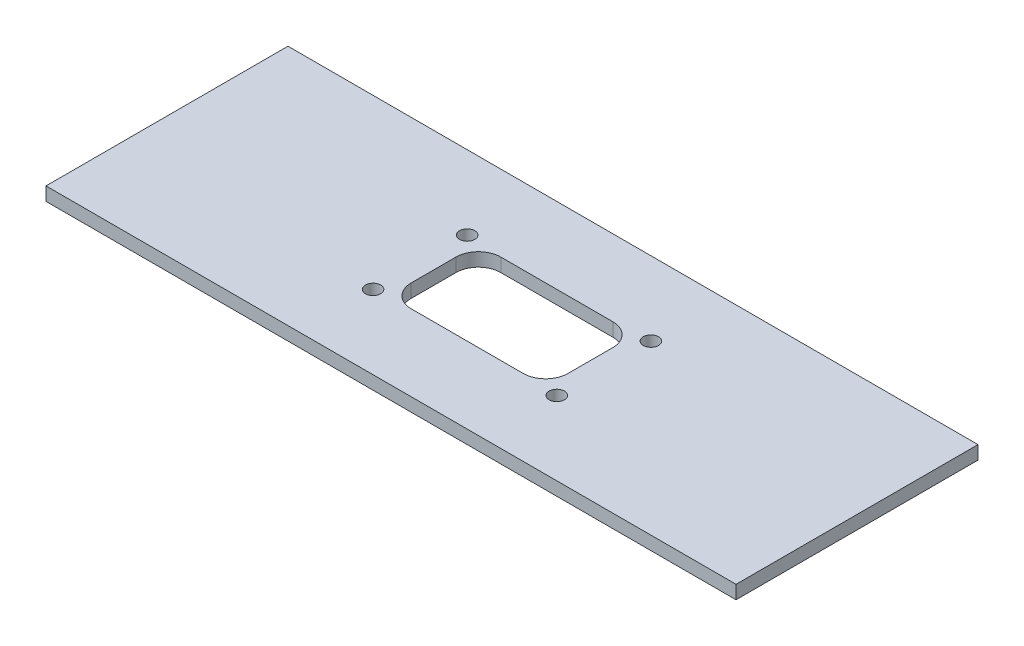
ISO-10303-21;
HEADER;
FILE_DESCRIPTION(('STEP AP214'),'2;1');
FILE_NAME('part.step','',(''),(''),'','','');
FILE_SCHEMA(('AUTOMOTIVE_DESIGN { 1 0 10303 214 1 1 1 1 }'));
ENDSEC;
DATA;
#1=APPLICATION_CONTEXT('core data for automotive mechanical design processes');
#2=APPLICATION_PROTOCOL_DEFINITION('international standard','automotive_design',2000,#1);
#3=PRODUCT_CONTEXT('',#1,'mechanical');
#4=PRODUCT('Part','Part','',(#3));
#5=PRODUCT_RELATED_PRODUCT_CATEGORY('part','',(#4));
#6=PRODUCT_DEFINITION_FORMATION('','',#4);
#7=PRODUCT_DEFINITION_CONTEXT('part definition',#1,'design');
#8=PRODUCT_DEFINITION('design','',#6,#7);
#9=PRODUCT_DEFINITION_SHAPE('','',#8);
#10=(LENGTH_UNIT() NAMED_UNIT(*) SI_UNIT(.MILLI.,.METRE.));
#11=(NAMED_UNIT(*) PLANE_ANGLE_UNIT() SI_UNIT($,.RADIAN.));
#12=(NAMED_UNIT(*) SI_UNIT($,.STERADIAN.) SOLID_ANGLE_UNIT());
#13=UNCERTAINTY_MEASURE_WITH_UNIT(LENGTH_MEASURE(1.E-05),#10,'distance_accuracy_value','');
#14=(GEOMETRIC_REPRESENTATION_CONTEXT(3) GLOBAL_UNCERTAINTY_ASSIGNED_CONTEXT((#13)) GLOBAL_UNIT_ASSIGNED_CONTEXT((#10,
#11,#12)) REPRESENTATION_CONTEXT('',''));
#15=CARTESIAN_POINT('',(0.,0.,0.));
#16=DIRECTION('',(0.,0.,1.));
#17=DIRECTION('',(1.,0.,0.));
#18=AXIS2_PLACEMENT_3D('',#15,#16,#17);
#19=CARTESIAN_POINT('',(154.,6.,54.));
#20=DIRECTION('',(-1.,0.,0.));
#21=DIRECTION('',(0.,0.,1.));
#22=AXIS2_PLACEMENT_3D('',#19,#20,#21);
#23=PLANE('',#22);
#24=DIRECTION('',(0.,0.,-1.));
#25=VECTOR('',#24,1.);
#26=CARTESIAN_POINT('',(154.,0.,54.));
#27=LINE('',#26,#25);
#28=CARTESIAN_POINT('',(154.,0.,54.));
#29=VERTEX_POINT('',#28);
#30=CARTESIAN_POINT('',(154.,0.,-54.));
#31=VERTEX_POINT('',#30);
#32=EDGE_CURVE('E200',#29,#31,#27,.T.);
#33=ORIENTED_EDGE('',*,*,#32,.T.);
#34=DIRECTION('',(0.,-1.,0.));
#35=VECTOR('',#34,1.);
#36=CARTESIAN_POINT('',(154.,6.,-54.));
#37=LINE('',#36,#35);
#38=CARTESIAN_POINT('',(154.,6.,-54.));
#39=VERTEX_POINT('',#38);
#40=EDGE_CURVE('E11',#39,#31,#37,.T.);
#41=ORIENTED_EDGE('',*,*,#40,.F.);
#42=DIRECTION('',(0.,0.,-1.));
#43=VECTOR('',#42,1.);
#44=CARTESIAN_POINT('',(154.,6.,54.));
#45=LINE('',#44,#43);
#46=CARTESIAN_POINT('',(154.,6.,54.));
#47=VERTEX_POINT('',#46);
#48=EDGE_CURVE('E201',#47,#39,#45,.T.);
#49=ORIENTED_EDGE('',*,*,#48,.F.);
#50=DIRECTION('',(0.,-1.,0.));
#51=VECTOR('',#50,1.);
#52=CARTESIAN_POINT('',(154.,6.,54.));
#53=LINE('',#52,#51);
#54=EDGE_CURVE('E211',#47,#29,#53,.T.);
#55=ORIENTED_EDGE('',*,*,#54,.T.);
#56=EDGE_LOOP('',(#33,#41,#49,#55));
#57=FACE_BOUND('',#56,.T.);
#58=ADVANCED_FACE('F42',(#57),#23,.F.);
#59=CARTESIAN_POINT('',(-154.,6.,-54.));
#60=DIRECTION('',(0.,0.,1.));
#61=DIRECTION('',(1.,0.,0.));
#62=AXIS2_PLACEMENT_3D('',#59,#60,#61);
#63=PLANE('',#62);
#64=DIRECTION('',(-1.,0.,0.));
#65=VECTOR('',#64,1.);
#66=CARTESIAN_POINT('',(-154.,0.,-54.));
#67=LINE('',#66,#65);
#68=CARTESIAN_POINT('',(-154.,0.,-54.));
#69=VERTEX_POINT('',#68);
#70=EDGE_CURVE('E214',#31,#69,#67,.T.);
#71=ORIENTED_EDGE('',*,*,#70,.T.);
#72=DIRECTION('',(0.,-1.,0.));
#73=VECTOR('',#72,1.);
#74=CARTESIAN_POINT('',(-154.,6.,-54.));
#75=LINE('',#74,#73);
#76=CARTESIAN_POINT('',(-154.,6.,-54.));
#77=VERTEX_POINT('',#76);
#78=EDGE_CURVE('E49',#77,#69,#75,.T.);
#79=ORIENTED_EDGE('',*,*,#78,.F.);
#80=DIRECTION('',(-1.,0.,0.));
#81=VECTOR('',#80,1.);
#82=CARTESIAN_POINT('',(-154.,6.,-54.));
#83=LINE('',#82,#81);
#84=EDGE_CURVE('E204',#39,#77,#83,.T.);
#85=ORIENTED_EDGE('',*,*,#84,.F.);
#86=ORIENTED_EDGE('',*,*,#40,.T.);
#87=EDGE_LOOP('',(#71,#79,#85,#86));
#88=FACE_BOUND('',#87,.T.);
#89=ADVANCED_FACE('F242',(#88),#63,.F.);
#90=CARTESIAN_POINT('',(-154.,6.,54.));
#91=DIRECTION('',(1.,0.,0.));
#92=DIRECTION('',(0.,0.,-1.));
#93=AXIS2_PLACEMENT_3D('',#90,#91,#92);
#94=PLANE('',#93);
#95=DIRECTION('',(0.,0.,1.));
#96=VECTOR('',#95,1.);
#97=CARTESIAN_POINT('',(-154.,0.,54.));
#98=LINE('',#97,#96);
#99=CARTESIAN_POINT('',(-154.,0.,54.));
#100=VERTEX_POINT('',#99);
#101=EDGE_CURVE('E216',#69,#100,#98,.T.);
#102=ORIENTED_EDGE('',*,*,#101,.T.);
#103=DIRECTION('',(0.,-1.,0.));
#104=VECTOR('',#103,1.);
#105=CARTESIAN_POINT('',(-154.,6.,54.));
#106=LINE('',#105,#104);
#107=CARTESIAN_POINT('',(-154.,6.,54.));
#108=VERTEX_POINT('',#107);
#109=EDGE_CURVE('E221',#108,#100,#106,.T.);
#110=ORIENTED_EDGE('',*,*,#109,.F.);
#111=DIRECTION('',(0.,0.,1.));
#112=VECTOR('',#111,1.);
#113=CARTESIAN_POINT('',(-154.,6.,54.));
#114=LINE('',#113,#112);
#115=EDGE_CURVE('E207',#77,#108,#114,.T.);
#116=ORIENTED_EDGE('',*,*,#115,.F.);
#117=ORIENTED_EDGE('',*,*,#78,.T.);
#118=EDGE_LOOP('',(#102,#110,#116,#117));
#119=FACE_BOUND('',#118,.T.);
#120=ADVANCED_FACE('F228',(#119),#94,.F.);
#121=CARTESIAN_POINT('',(-154.,6.,54.));
#122=DIRECTION('',(0.,0.,-1.));
#123=DIRECTION('',(-1.,0.,0.));
#124=AXIS2_PLACEMENT_3D('',#121,#122,#123);
#125=PLANE('',#124);
#126=DIRECTION('',(1.,0.,0.));
#127=VECTOR('',#126,1.);
#128=CARTESIAN_POINT('',(-154.,0.,54.));
#129=LINE('',#128,#127);
#130=EDGE_CURVE('E205',#100,#29,#129,.T.);
#131=ORIENTED_EDGE('',*,*,#130,.T.);
#132=ORIENTED_EDGE('',*,*,#54,.F.);
#133=DIRECTION('',(1.,0.,0.));
#134=VECTOR('',#133,1.);
#135=CARTESIAN_POINT('',(-154.,6.,54.));
#136=LINE('',#135,#134);
#137=EDGE_CURVE('E209',#108,#47,#136,.T.);
#138=ORIENTED_EDGE('',*,*,#137,.F.);
#139=ORIENTED_EDGE('',*,*,#109,.T.);
#140=EDGE_LOOP('',(#131,#132,#138,#139));
#141=FACE_BOUND('',#140,.T.);
#142=ADVANCED_FACE('F235',(#141),#125,.F.);
#143=CARTESIAN_POINT('',(0.,6.,0.));
#144=DIRECTION('',(0.,-1.,0.));
#145=DIRECTION('',(0.,0.,-1.));
#146=AXIS2_PLACEMENT_3D('',#143,#144,#145);
#147=PLANE('',#146);
#148=CARTESIAN_POINT('',(-41.,6.,-21.));
#149=DIRECTION('',(0.,-1.,0.));
#150=DIRECTION('',(0.,0.,1.));
#151=AXIS2_PLACEMENT_3D('',#148,#149,#150);
#152=CIRCLE('',#151,3.4);
#153=CARTESIAN_POINT('',(-41.,6.,-17.6));
#154=VERTEX_POINT('',#153);
#155=EDGE_CURVE('E320',#154,#154,#152,.T.);
#156=ORIENTED_EDGE('',*,*,#155,.T.);
#157=EDGE_LOOP('',(#156));
#158=FACE_BOUND('',#157,.T.);
#159=CARTESIAN_POINT('',(41.,6.,21.));
#160=DIRECTION('',(0.,-1.,0.));
#161=DIRECTION('',(0.,0.,1.));
#162=AXIS2_PLACEMENT_3D('',#159,#160,#161);
#163=CIRCLE('',#162,3.4);
#164=CARTESIAN_POINT('',(41.,6.,24.4));
#165=VERTEX_POINT('',#164);
#166=EDGE_CURVE('E310',#165,#165,#163,.T.);
#167=ORIENTED_EDGE('',*,*,#166,.T.);
#168=EDGE_LOOP('',(#167));
#169=FACE_BOUND('',#168,.T.);
#170=CARTESIAN_POINT('',(-41.,6.,21.));
#171=DIRECTION('',(0.,-1.,0.));
#172=DIRECTION('',(0.,0.,-1.));
#173=AXIS2_PLACEMENT_3D('',#170,#171,#172);
#174=CIRCLE('',#173,3.4);
#175=CARTESIAN_POINT('',(-41.,6.,17.6));
#176=VERTEX_POINT('',#175);
#177=EDGE_CURVE('E305',#176,#176,#174,.T.);
#178=ORIENTED_EDGE('',*,*,#177,.T.);
#179=EDGE_LOOP('',(#178));
#180=FACE_BOUND('',#179,.T.);
#181=CARTESIAN_POINT('',(41.,6.,-21.));
#182=DIRECTION('',(0.,-1.,0.));
#183=DIRECTION('',(0.,0.,-1.));
#184=AXIS2_PLACEMENT_3D('',#181,#182,#183);
#185=CIRCLE('',#184,3.4);
#186=CARTESIAN_POINT('',(41.,6.,-24.4));
#187=VERTEX_POINT('',#186);
#188=EDGE_CURVE('E326',#187,#187,#185,.T.);
#189=ORIENTED_EDGE('',*,*,#188,.T.);
#190=EDGE_LOOP('',(#189));
#191=FACE_BOUND('',#190,.T.);
#192=DIRECTION('',(-1.,0.,0.));
#193=VECTOR('',#192,1.);
#194=CARTESIAN_POINT('',(0.,6.,20.));
#195=LINE('',#194,#193);
#196=CARTESIAN_POINT('',(24.9999999999999,6.,20.));
#197=VERTEX_POINT('',#196);
#198=CARTESIAN_POINT('',(-24.9999999999999,6.,20.));
#199=VERTEX_POINT('',#198);
#200=EDGE_CURVE('E194',#197,#199,#195,.T.);
#201=ORIENTED_EDGE('',*,*,#200,.T.);
#202=CARTESIAN_POINT('',(-25.,6.,10.));
#203=DIRECTION('',(0.,-1.,0.));
#204=DIRECTION('',(0.,0.,-1.));
#205=AXIS2_PLACEMENT_3D('',#202,#203,#204);
#206=CIRCLE('',#205,10.);
#207=CARTESIAN_POINT('',(-35.,6.,9.99999999999993));
#208=VERTEX_POINT('',#207);
#209=EDGE_CURVE('E197',#199,#208,#206,.T.);
#210=ORIENTED_EDGE('',*,*,#209,.T.);
#211=DIRECTION('',(0.,0.,-1.));
#212=VECTOR('',#211,1.);
#213=CARTESIAN_POINT('',(-35.,6.,0.));
#214=LINE('',#213,#212);
#215=CARTESIAN_POINT('',(-35.,6.,-9.99999999999993));
#216=VERTEX_POINT('',#215);
#217=EDGE_CURVE('E169',#208,#216,#214,.T.);
#218=ORIENTED_EDGE('',*,*,#217,.T.);
#219=CARTESIAN_POINT('',(-25.,6.,-10.));
#220=DIRECTION('',(0.,-1.,0.));
#221=DIRECTION('',(0.,0.,-1.));
#222=AXIS2_PLACEMENT_3D('',#219,#220,#221);
#223=CIRCLE('',#222,10.);
#224=CARTESIAN_POINT('',(-24.9999999999999,6.,-20.));
#225=VERTEX_POINT('',#224);
#226=EDGE_CURVE('E136',#216,#225,#223,.T.);
#227=ORIENTED_EDGE('',*,*,#226,.T.);
#228=DIRECTION('',(1.,0.,0.));
#229=VECTOR('',#228,1.);
#230=CARTESIAN_POINT('',(0.,6.,-20.));
#231=LINE('',#230,#229);
#232=CARTESIAN_POINT('',(24.9999999999999,6.,-20.));
#233=VERTEX_POINT('',#232);
#234=EDGE_CURVE('E182',#225,#233,#231,.T.);
#235=ORIENTED_EDGE('',*,*,#234,.T.);
#236=CARTESIAN_POINT('',(25.,6.,-10.));
#237=DIRECTION('',(0.,-1.,0.));
#238=DIRECTION('',(0.,0.,-1.));
#239=AXIS2_PLACEMENT_3D('',#236,#237,#238);
#240=CIRCLE('',#239,10.);
#241=CARTESIAN_POINT('',(35.,6.,-9.99999999999993));
#242=VERTEX_POINT('',#241);
#243=EDGE_CURVE('E185',#233,#242,#240,.T.);
#244=ORIENTED_EDGE('',*,*,#243,.T.);
#245=DIRECTION('',(0.,0.,1.));
#246=VECTOR('',#245,1.);
#247=CARTESIAN_POINT('',(35.,6.,0.));
#248=LINE('',#247,#246);
#249=CARTESIAN_POINT('',(35.,6.,9.99999999999993));
#250=VERTEX_POINT('',#249);
#251=EDGE_CURVE('E188',#242,#250,#248,.T.);
#252=ORIENTED_EDGE('',*,*,#251,.T.);
#253=CARTESIAN_POINT('',(25.,6.,10.));
#254=DIRECTION('',(0.,-1.,0.));
#255=DIRECTION('',(0.,0.,-1.));
#256=AXIS2_PLACEMENT_3D('',#253,#254,#255);
#257=CIRCLE('',#256,10.);
#258=EDGE_CURVE('E191',#250,#197,#257,.T.);
#259=ORIENTED_EDGE('',*,*,#258,.T.);
#260=EDGE_LOOP('',(#201,#210,#218,#227,#235,#244,#252,#259));
#261=FACE_BOUND('',#260,.T.);
#262=ORIENTED_EDGE('',*,*,#48,.T.);
#263=ORIENTED_EDGE('',*,*,#84,.T.);
#264=ORIENTED_EDGE('',*,*,#115,.T.);
#265=ORIENTED_EDGE('',*,*,#137,.T.);
#266=EDGE_LOOP('',(#262,#263,#264,#265));
#267=FACE_BOUND('',#266,.T.);
#268=ADVANCED_FACE('F241',(#158,#169,#180,#191,#261,#267),#147,.F.);
#269=CARTESIAN_POINT('',(0.,0.,0.));
#270=DIRECTION('',(0.,-1.,0.));
#271=DIRECTION('',(0.,0.,-1.));
#272=AXIS2_PLACEMENT_3D('',#269,#270,#271);
#273=PLANE('',#272);
#274=CARTESIAN_POINT('',(-41.,0.,-21.));
#275=DIRECTION('',(0.,-1.,0.));
#276=DIRECTION('',(0.,0.,1.));
#277=AXIS2_PLACEMENT_3D('',#274,#275,#276);
#278=CIRCLE('',#277,3.4);
#279=CARTESIAN_POINT('',(-41.,0.,-17.6));
#280=VERTEX_POINT('',#279);
#281=EDGE_CURVE('E323',#280,#280,#278,.T.);
#282=ORIENTED_EDGE('',*,*,#281,.F.);
#283=EDGE_LOOP('',(#282));
#284=FACE_BOUND('',#283,.T.);
#285=CARTESIAN_POINT('',(41.,0.,21.));
#286=DIRECTION('',(0.,-1.,0.));
#287=DIRECTION('',(0.,0.,1.));
#288=AXIS2_PLACEMENT_3D('',#285,#286,#287);
#289=CIRCLE('',#288,3.4);
#290=CARTESIAN_POINT('',(41.,0.,24.4));
#291=VERTEX_POINT('',#290);
#292=EDGE_CURVE('E315',#291,#291,#289,.T.);
#293=ORIENTED_EDGE('',*,*,#292,.F.);
#294=EDGE_LOOP('',(#293));
#295=FACE_BOUND('',#294,.T.);
#296=CARTESIAN_POINT('',(-41.,0.,21.));
#297=DIRECTION('',(0.,-1.,0.));
#298=DIRECTION('',(0.,0.,-1.));
#299=AXIS2_PLACEMENT_3D('',#296,#297,#298);
#300=CIRCLE('',#299,3.4);
#301=CARTESIAN_POINT('',(-41.,0.,17.6));
#302=VERTEX_POINT('',#301);
#303=EDGE_CURVE('E308',#302,#302,#300,.T.);
#304=ORIENTED_EDGE('',*,*,#303,.F.);
#305=EDGE_LOOP('',(#304));
#306=FACE_BOUND('',#305,.T.);
#307=CARTESIAN_POINT('',(41.,0.,-21.));
#308=DIRECTION('',(0.,-1.,0.));
#309=DIRECTION('',(0.,0.,-1.));
#310=AXIS2_PLACEMENT_3D('',#307,#308,#309);
#311=CIRCLE('',#310,3.4);
#312=CARTESIAN_POINT('',(41.,0.,-24.4));
#313=VERTEX_POINT('',#312);
#314=EDGE_CURVE('E312',#313,#313,#311,.T.);
#315=ORIENTED_EDGE('',*,*,#314,.F.);
#316=EDGE_LOOP('',(#315));
#317=FACE_BOUND('',#316,.T.);
#318=CARTESIAN_POINT('',(-25.,0.,10.));
#319=DIRECTION('',(0.,-1.,0.));
#320=DIRECTION('',(0.,0.,1.));
#321=AXIS2_PLACEMENT_3D('',#318,#319,#320);
#322=CIRCLE('',#321,10.);
#323=CARTESIAN_POINT('',(-24.9999999999999,0.,20.));
#324=VERTEX_POINT('',#323);
#325=CARTESIAN_POINT('',(-35.,0.,9.99999999999993));
#326=VERTEX_POINT('',#325);
#327=EDGE_CURVE('E64',#324,#326,#322,.T.);
#328=ORIENTED_EDGE('',*,*,#327,.F.);
#329=DIRECTION('',(-1.,0.,0.));
#330=VECTOR('',#329,1.);
#331=CARTESIAN_POINT('',(-24.9999999999999,0.,20.));
#332=LINE('',#331,#330);
#333=CARTESIAN_POINT('',(24.9999999999999,0.,20.));
#334=VERTEX_POINT('',#333);
#335=EDGE_CURVE('E164',#334,#324,#332,.T.);
#336=ORIENTED_EDGE('',*,*,#335,.F.);
#337=CARTESIAN_POINT('',(25.,0.,10.));
#338=DIRECTION('',(0.,-1.,0.));
#339=DIRECTION('',(0.,0.,1.));
#340=AXIS2_PLACEMENT_3D('',#337,#338,#339);
#341=CIRCLE('',#340,10.);
#342=CARTESIAN_POINT('',(35.,0.,9.99999999999993));
#343=VERTEX_POINT('',#342);
#344=EDGE_CURVE('E161',#343,#334,#341,.T.);
#345=ORIENTED_EDGE('',*,*,#344,.F.);
#346=DIRECTION('',(0.,0.,1.));
#347=VECTOR('',#346,1.);
#348=CARTESIAN_POINT('',(35.,0.,-9.99999999999993));
#349=LINE('',#348,#347);
#350=CARTESIAN_POINT('',(35.,0.,-9.99999999999993));
#351=VERTEX_POINT('',#350);
#352=EDGE_CURVE('E158',#351,#343,#349,.T.);
#353=ORIENTED_EDGE('',*,*,#352,.F.);
#354=CARTESIAN_POINT('',(25.,0.,-10.));
#355=DIRECTION('',(0.,-1.,0.));
#356=DIRECTION('',(0.,0.,-1.));
#357=AXIS2_PLACEMENT_3D('',#354,#355,#356);
#358=CIRCLE('',#357,10.);
#359=CARTESIAN_POINT('',(24.9999999999999,0.,-20.));
#360=VERTEX_POINT('',#359);
#361=EDGE_CURVE('E152',#360,#351,#358,.T.);
#362=ORIENTED_EDGE('',*,*,#361,.F.);
#363=DIRECTION('',(1.,0.,0.));
#364=VECTOR('',#363,1.);
#365=CARTESIAN_POINT('',(-24.9999999999999,0.,-20.));
#366=LINE('',#365,#364);
#367=CARTESIAN_POINT('',(-24.9999999999999,0.,-20.));
#368=VERTEX_POINT('',#367);
#369=EDGE_CURVE('E150',#368,#360,#366,.T.);
#370=ORIENTED_EDGE('',*,*,#369,.F.);
#371=CARTESIAN_POINT('',(-25.,0.,-10.));
#372=DIRECTION('',(0.,-1.,0.));
#373=DIRECTION('',(0.,0.,1.));
#374=AXIS2_PLACEMENT_3D('',#371,#372,#373);
#375=CIRCLE('',#374,10.);
#376=CARTESIAN_POINT('',(-35.,0.,-9.99999999999993));
#377=VERTEX_POINT('',#376);
#378=EDGE_CURVE('E133',#377,#368,#375,.T.);
#379=ORIENTED_EDGE('',*,*,#378,.F.);
#380=DIRECTION('',(0.,0.,-1.));
#381=VECTOR('',#380,1.);
#382=CARTESIAN_POINT('',(-35.,0.,-9.99999999999993));
#383=LINE('',#382,#381);
#384=EDGE_CURVE('E142',#326,#377,#383,.T.);
#385=ORIENTED_EDGE('',*,*,#384,.F.);
#386=EDGE_LOOP('',(#328,#336,#345,#353,#362,#370,#379,#385));
#387=FACE_BOUND('',#386,.T.);
#388=ORIENTED_EDGE('',*,*,#32,.F.);
#389=ORIENTED_EDGE('',*,*,#130,.F.);
#390=ORIENTED_EDGE('',*,*,#101,.F.);
#391=ORIENTED_EDGE('',*,*,#70,.F.);
#392=EDGE_LOOP('',(#388,#389,#390,#391));
#393=FACE_BOUND('',#392,.T.);
#394=ADVANCED_FACE('F146',(#284,#295,#306,#317,#387,#393),#273,.T.);
#395=CARTESIAN_POINT('',(-25.,10.,10.));
#396=DIRECTION('',(0.,-1.,0.));
#397=DIRECTION('',(0.,0.,-1.));
#398=AXIS2_PLACEMENT_3D('',#395,#396,#397);
#399=CYLINDRICAL_SURFACE('',#398,10.);
#400=DIRECTION('',(0.,-1.,0.));
#401=VECTOR('',#400,1.);
#402=CARTESIAN_POINT('',(-24.9999999999999,10.,20.));
#403=LINE('',#402,#401);
#404=EDGE_CURVE('E167',#199,#324,#403,.T.);
#405=ORIENTED_EDGE('',*,*,#404,.T.);
#406=ORIENTED_EDGE('',*,*,#327,.T.);
#407=DIRECTION('',(0.,-1.,0.));
#408=VECTOR('',#407,1.);
#409=CARTESIAN_POINT('',(-35.,10.,9.99999999999993));
#410=LINE('',#409,#408);
#411=EDGE_CURVE('E139',#208,#326,#410,.T.);
#412=ORIENTED_EDGE('',*,*,#411,.F.);
#413=ORIENTED_EDGE('',*,*,#209,.F.);
#414=EDGE_LOOP('',(#405,#406,#412,#413));
#415=FACE_BOUND('',#414,.T.);
#416=ADVANCED_FACE('F254',(#415),#399,.F.);
#417=CARTESIAN_POINT('',(-24.9999999999999,10.,20.));
#418=DIRECTION('',(0.,0.,1.));
#419=DIRECTION('',(1.,0.,0.));
#420=AXIS2_PLACEMENT_3D('',#417,#418,#419);
#421=PLANE('',#420);
#422=DIRECTION('',(0.,-1.,0.));
#423=VECTOR('',#422,1.);
#424=CARTESIAN_POINT('',(24.9999999999999,10.,20.));
#425=LINE('',#424,#423);
#426=EDGE_CURVE('E170',#197,#334,#425,.T.);
#427=ORIENTED_EDGE('',*,*,#426,.T.);
#428=ORIENTED_EDGE('',*,*,#335,.T.);
#429=ORIENTED_EDGE('',*,*,#404,.F.);
#430=ORIENTED_EDGE('',*,*,#200,.F.);
#431=EDGE_LOOP('',(#427,#428,#429,#430));
#432=FACE_BOUND('',#431,.T.);
#433=ADVANCED_FACE('F261',(#432),#421,.F.);
#434=CARTESIAN_POINT('',(25.,10.,10.));
#435=DIRECTION('',(0.,-1.,0.));
#436=DIRECTION('',(0.,0.,-1.));
#437=AXIS2_PLACEMENT_3D('',#434,#435,#436);
#438=CYLINDRICAL_SURFACE('',#437,10.);
#439=DIRECTION('',(0.,-1.,0.));
#440=VECTOR('',#439,1.);
#441=CARTESIAN_POINT('',(35.,10.,9.99999999999993));
#442=LINE('',#441,#440);
#443=EDGE_CURVE('E172',#250,#343,#442,.T.);
#444=ORIENTED_EDGE('',*,*,#443,.T.);
#445=ORIENTED_EDGE('',*,*,#344,.T.);
#446=ORIENTED_EDGE('',*,*,#426,.F.);
#447=ORIENTED_EDGE('',*,*,#258,.F.);
#448=EDGE_LOOP('',(#444,#445,#446,#447));
#449=FACE_BOUND('',#448,.T.);
#450=ADVANCED_FACE('F278',(#449),#438,.F.);
#451=CARTESIAN_POINT('',(35.,10.,-9.99999999999993));
#452=DIRECTION('',(1.,0.,0.));
#453=DIRECTION('',(0.,0.,-1.));
#454=AXIS2_PLACEMENT_3D('',#451,#452,#453);
#455=PLANE('',#454);
#456=DIRECTION('',(0.,-1.,0.));
#457=VECTOR('',#456,1.);
#458=CARTESIAN_POINT('',(35.,10.,-9.99999999999993));
#459=LINE('',#458,#457);
#460=EDGE_CURVE('E174',#242,#351,#459,.T.);
#461=ORIENTED_EDGE('',*,*,#460,.T.);
#462=ORIENTED_EDGE('',*,*,#352,.T.);
#463=ORIENTED_EDGE('',*,*,#443,.F.);
#464=ORIENTED_EDGE('',*,*,#251,.F.);
#465=EDGE_LOOP('',(#461,#462,#463,#464));
#466=FACE_BOUND('',#465,.T.);
#467=ADVANCED_FACE('F274',(#466),#455,.F.);
#468=CARTESIAN_POINT('',(25.,10.,-10.));
#469=DIRECTION('',(0.,-1.,0.));
#470=DIRECTION('',(0.,0.,-1.));
#471=AXIS2_PLACEMENT_3D('',#468,#469,#470);
#472=CYLINDRICAL_SURFACE('',#471,10.);
#473=DIRECTION('',(0.,-1.,0.));
#474=VECTOR('',#473,1.);
#475=CARTESIAN_POINT('',(24.9999999999999,10.,-20.));
#476=LINE('',#475,#474);
#477=EDGE_CURVE('E176',#233,#360,#476,.T.);
#478=ORIENTED_EDGE('',*,*,#477,.T.);
#479=ORIENTED_EDGE('',*,*,#361,.T.);
#480=ORIENTED_EDGE('',*,*,#460,.F.);
#481=ORIENTED_EDGE('',*,*,#243,.F.);
#482=EDGE_LOOP('',(#478,#479,#480,#481));
#483=FACE_BOUND('',#482,.T.);
#484=ADVANCED_FACE('F270',(#483),#472,.F.);
#485=CARTESIAN_POINT('',(-24.9999999999999,10.,-20.));
#486=DIRECTION('',(0.,0.,-1.));
#487=DIRECTION('',(-1.,0.,0.));
#488=AXIS2_PLACEMENT_3D('',#485,#486,#487);
#489=PLANE('',#488);
#490=DIRECTION('',(0.,-1.,0.));
#491=VECTOR('',#490,1.);
#492=CARTESIAN_POINT('',(-24.9999999999999,10.,-20.));
#493=LINE('',#492,#491);
#494=EDGE_CURVE('E138',#225,#368,#493,.T.);
#495=ORIENTED_EDGE('',*,*,#494,.T.);
#496=ORIENTED_EDGE('',*,*,#369,.T.);
#497=ORIENTED_EDGE('',*,*,#477,.F.);
#498=ORIENTED_EDGE('',*,*,#234,.F.);
#499=EDGE_LOOP('',(#495,#496,#497,#498));
#500=FACE_BOUND('',#499,.T.);
#501=ADVANCED_FACE('F267',(#500),#489,.F.);
#502=CARTESIAN_POINT('',(-25.,10.,-10.));
#503=DIRECTION('',(0.,-1.,0.));
#504=DIRECTION('',(0.,0.,-1.));
#505=AXIS2_PLACEMENT_3D('',#502,#503,#504);
#506=CYLINDRICAL_SURFACE('',#505,10.);
#507=DIRECTION('',(0.,-1.,0.));
#508=VECTOR('',#507,1.);
#509=CARTESIAN_POINT('',(-35.,10.,-9.99999999999993));
#510=LINE('',#509,#508);
#511=EDGE_CURVE('E56',#216,#377,#510,.T.);
#512=ORIENTED_EDGE('',*,*,#511,.T.);
#513=ORIENTED_EDGE('',*,*,#378,.T.);
#514=ORIENTED_EDGE('',*,*,#494,.F.);
#515=ORIENTED_EDGE('',*,*,#226,.F.);
#516=EDGE_LOOP('',(#512,#513,#514,#515));
#517=FACE_BOUND('',#516,.T.);
#518=ADVANCED_FACE('F130',(#517),#506,.F.);
#519=CARTESIAN_POINT('',(-35.,10.,-9.99999999999993));
#520=DIRECTION('',(-1.,0.,0.));
#521=DIRECTION('',(0.,0.,1.));
#522=AXIS2_PLACEMENT_3D('',#519,#520,#521);
#523=PLANE('',#522);
#524=ORIENTED_EDGE('',*,*,#411,.T.);
#525=ORIENTED_EDGE('',*,*,#384,.T.);
#526=ORIENTED_EDGE('',*,*,#511,.F.);
#527=ORIENTED_EDGE('',*,*,#217,.F.);
#528=EDGE_LOOP('',(#524,#525,#526,#527));
#529=FACE_BOUND('',#528,.T.);
#530=ADVANCED_FACE('F143',(#529),#523,.F.);
#531=CARTESIAN_POINT('',(41.,6.,-21.));
#532=DIRECTION('',(0.,-1.,0.));
#533=DIRECTION('',(0.,0.,-1.));
#534=AXIS2_PLACEMENT_3D('',#531,#532,#533);
#535=CYLINDRICAL_SURFACE('',#534,3.4);
#536=ORIENTED_EDGE('',*,*,#188,.F.);
#537=EDGE_LOOP('',(#536));
#538=FACE_BOUND('',#537,.T.);
#539=ORIENTED_EDGE('',*,*,#314,.T.);
#540=EDGE_LOOP('',(#539));
#541=FACE_BOUND('',#540,.T.);
#542=ADVANCED_FACE('F264',(#538,#541),#535,.F.);
#543=CARTESIAN_POINT('',(-41.,6.,21.));
#544=DIRECTION('',(0.,-1.,0.));
#545=DIRECTION('',(0.,0.,-1.));
#546=AXIS2_PLACEMENT_3D('',#543,#544,#545);
#547=CYLINDRICAL_SURFACE('',#546,3.4);
#548=ORIENTED_EDGE('',*,*,#177,.F.);
#549=EDGE_LOOP('',(#548));
#550=FACE_BOUND('',#549,.T.);
#551=ORIENTED_EDGE('',*,*,#303,.T.);
#552=EDGE_LOOP('',(#551));
#553=FACE_BOUND('',#552,.T.);
#554=ADVANCED_FACE('F288',(#550,#553),#547,.F.);
#555=CARTESIAN_POINT('',(41.,6.,21.));
#556=DIRECTION('',(0.,-1.,0.));
#557=DIRECTION('',(0.,0.,-1.));
#558=AXIS2_PLACEMENT_3D('',#555,#556,#557);
#559=CYLINDRICAL_SURFACE('',#558,3.4);
#560=ORIENTED_EDGE('',*,*,#166,.F.);
#561=EDGE_LOOP('',(#560));
#562=FACE_BOUND('',#561,.T.);
#563=ORIENTED_EDGE('',*,*,#292,.T.);
#564=EDGE_LOOP('',(#563));
#565=FACE_BOUND('',#564,.T.);
#566=ADVANCED_FACE('F293',(#562,#565),#559,.F.);
#567=CARTESIAN_POINT('',(-41.,6.,-21.));
#568=DIRECTION('',(0.,-1.,0.));
#569=DIRECTION('',(0.,0.,-1.));
#570=AXIS2_PLACEMENT_3D('',#567,#568,#569);
#571=CYLINDRICAL_SURFACE('',#570,3.4);
#572=ORIENTED_EDGE('',*,*,#155,.F.);
#573=EDGE_LOOP('',(#572));
#574=FACE_BOUND('',#573,.T.);
#575=ORIENTED_EDGE('',*,*,#281,.T.);
#576=EDGE_LOOP('',(#575));
#577=FACE_BOUND('',#576,.T.);
#578=ADVANCED_FACE('F290',(#574,#577),#571,.F.);
#579=CLOSED_SHELL('',(#58,#89,#120,#142,#268,#394,#416,#433,#450,#467,#484,#501,#518,#530,#542,
#554,#566,#578));
#580=MANIFOLD_SOLID_BREP('B2',#579);
#581=ADVANCED_BREP_SHAPE_REPRESENTATION('',(#18,#580),#14);
#582=SHAPE_DEFINITION_REPRESENTATION(#9,#581);
ENDSEC;
END-ISO-10303-21;
